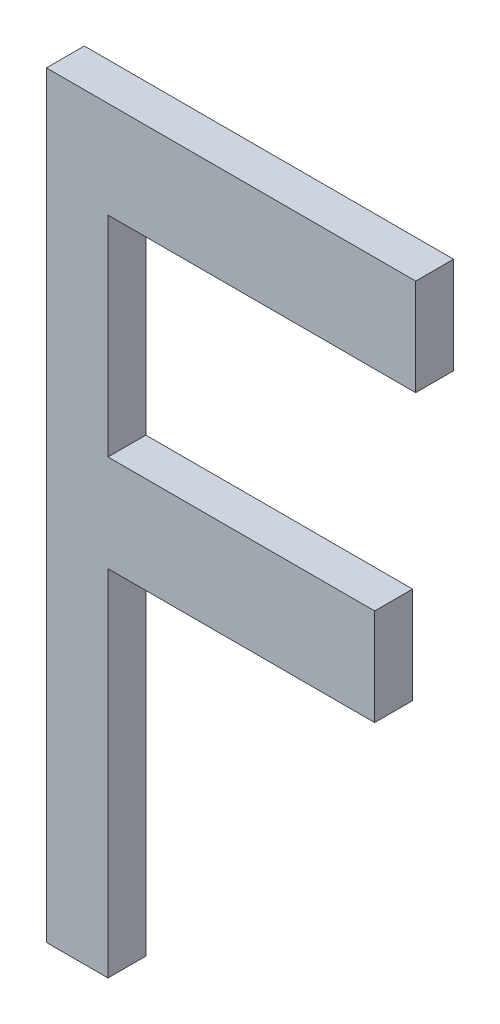
ISO-10303-21;
HEADER;
FILE_DESCRIPTION(('STEP AP214'),'2;1');
FILE_NAME('part.step','',(''),(''),'','','');
FILE_SCHEMA(('AUTOMOTIVE_DESIGN { 1 0 10303 214 1 1 1 1 }'));
ENDSEC;
DATA;
#1=APPLICATION_CONTEXT('core data for automotive mechanical design processes');
#2=APPLICATION_PROTOCOL_DEFINITION('international standard','automotive_design',2000,#1);
#3=PRODUCT_CONTEXT('',#1,'mechanical');
#4=PRODUCT('Part','Part','',(#3));
#5=PRODUCT_RELATED_PRODUCT_CATEGORY('part','',(#4));
#6=PRODUCT_DEFINITION_FORMATION('','',#4);
#7=PRODUCT_DEFINITION_CONTEXT('part definition',#1,'design');
#8=PRODUCT_DEFINITION('design','',#6,#7);
#9=PRODUCT_DEFINITION_SHAPE('','',#8);
#10=(LENGTH_UNIT() NAMED_UNIT(*) SI_UNIT(.MILLI.,.METRE.));
#11=(NAMED_UNIT(*) PLANE_ANGLE_UNIT() SI_UNIT($,.RADIAN.));
#12=(NAMED_UNIT(*) SI_UNIT($,.STERADIAN.) SOLID_ANGLE_UNIT());
#13=UNCERTAINTY_MEASURE_WITH_UNIT(LENGTH_MEASURE(1.E-05),#10,'distance_accuracy_value','');
#14=(GEOMETRIC_REPRESENTATION_CONTEXT(3) GLOBAL_UNCERTAINTY_ASSIGNED_CONTEXT((#13)) GLOBAL_UNIT_ASSIGNED_CONTEXT((#10,
#11,#12)) REPRESENTATION_CONTEXT('',''));
#15=CARTESIAN_POINT('',(0.,0.,0.));
#16=DIRECTION('',(0.,0.,1.));
#17=DIRECTION('',(1.,0.,0.));
#18=AXIS2_PLACEMENT_3D('',#15,#16,#17);
#19=CARTESIAN_POINT('',(51.9128238250903,28.1761107349725,5.9));
#20=DIRECTION('',(0.,0.,1.));
#21=DIRECTION('',(1.,0.,0.));
#22=AXIS2_PLACEMENT_3D('',#19,#20,#21);
#23=PLANE('',#22);
#24=DIRECTION('',(1.,0.,0.));
#25=VECTOR('',#24,1.);
#26=CARTESIAN_POINT('',(51.9128238250903,30.1761107349725,5.9));
#27=LINE('',#26,#25);
#28=CARTESIAN_POINT('',(52.8878238250904,30.1761107349725,5.9));
#29=VERTEX_POINT('',#28);
#30=CARTESIAN_POINT('',(51.9128238250904,30.1761107349725,5.9));
#31=VERTEX_POINT('',#30);
#32=EDGE_CURVE('E126',#29,#31,#27,.F.);
#33=ORIENTED_EDGE('',*,*,#32,.F.);
#34=DIRECTION('',(0.,1.,0.));
#35=VECTOR('',#34,1.);
#36=CARTESIAN_POINT('',(52.8878238250904,28.1761107349725,5.9));
#37=LINE('',#36,#35);
#38=CARTESIAN_POINT('',(52.8878238250904,29.9207916164725,5.9));
#39=VERTEX_POINT('',#38);
#40=EDGE_CURVE('E124',#39,#29,#37,.T.);
#41=ORIENTED_EDGE('',*,*,#40,.F.);
#42=DIRECTION('',(1.,0.,0.));
#43=VECTOR('',#42,1.);
#44=CARTESIAN_POINT('',(51.9128238250903,29.9207916164725,5.9));
#45=LINE('',#44,#43);
#46=CARTESIAN_POINT('',(52.0753238250903,29.9207916164725,5.9));
#47=VERTEX_POINT('',#46);
#48=EDGE_CURVE('E122',#47,#39,#45,.T.);
#49=ORIENTED_EDGE('',*,*,#48,.F.);
#50=DIRECTION('',(0.,1.,0.));
#51=VECTOR('',#50,1.);
#52=CARTESIAN_POINT('',(52.0753238250903,28.1761107349725,5.9));
#53=LINE('',#52,#51);
#54=CARTESIAN_POINT('',(52.0753238250903,29.3676000738525,5.9));
#55=VERTEX_POINT('',#54);
#56=EDGE_CURVE('E120',#55,#47,#53,.T.);
#57=ORIENTED_EDGE('',*,*,#56,.F.);
#58=DIRECTION('',(1.,0.,0.));
#59=VECTOR('',#58,1.);
#60=CARTESIAN_POINT('',(51.9128238250903,29.3676000738525,5.9));
#61=LINE('',#60,#59);
#62=CARTESIAN_POINT('',(52.7794905175803,29.3676000738525,5.9));
#63=VERTEX_POINT('',#62);
#64=EDGE_CURVE('E118',#63,#55,#61,.F.);
#65=ORIENTED_EDGE('',*,*,#64,.F.);
#66=DIRECTION('',(0.,1.,0.));
#67=VECTOR('',#66,1.);
#68=CARTESIAN_POINT('',(52.7794905175803,28.1761107349725,5.9));
#69=LINE('',#68,#67);
#70=CARTESIAN_POINT('',(52.7794905175803,29.1122809553525,5.9));
#71=VERTEX_POINT('',#70);
#72=EDGE_CURVE('E114',#71,#63,#69,.T.);
#73=ORIENTED_EDGE('',*,*,#72,.F.);
#74=DIRECTION('',(1.,0.,0.));
#75=VECTOR('',#74,1.);
#76=CARTESIAN_POINT('',(51.9128238250903,29.1122809553525,5.9));
#77=LINE('',#76,#75);
#78=CARTESIAN_POINT('',(52.0753238250903,29.1122809553525,5.9));
#79=VERTEX_POINT('',#78);
#80=EDGE_CURVE('E113',#79,#71,#77,.T.);
#81=ORIENTED_EDGE('',*,*,#80,.F.);
#82=DIRECTION('',(0.,1.,0.));
#83=VECTOR('',#82,1.);
#84=CARTESIAN_POINT('',(52.0753238250903,28.1761107349725,5.9));
#85=LINE('',#84,#83);
#86=CARTESIAN_POINT('',(52.0753238250903,28.1761107349725,5.9));
#87=VERTEX_POINT('',#86);
#88=EDGE_CURVE('E91',#87,#79,#85,.T.);
#89=ORIENTED_EDGE('',*,*,#88,.F.);
#90=DIRECTION('',(1.,0.,0.));
#91=VECTOR('',#90,1.);
#92=CARTESIAN_POINT('',(51.9128238250903,28.1761107349725,5.9));
#93=LINE('',#92,#91);
#94=CARTESIAN_POINT('',(51.9128238250904,28.1761107349725,5.9));
#95=VERTEX_POINT('',#94);
#96=EDGE_CURVE('E20',#95,#87,#93,.T.);
#97=ORIENTED_EDGE('',*,*,#96,.F.);
#98=DIRECTION('',(0.,1.,0.));
#99=VECTOR('',#98,1.);
#100=CARTESIAN_POINT('',(51.9128238250904,30.1761107349725,5.9));
#101=LINE('',#100,#99);
#102=EDGE_CURVE('E128',#95,#31,#101,.T.);
#103=ORIENTED_EDGE('',*,*,#102,.T.);
#104=EDGE_LOOP('',(#33,#41,#49,#57,#65,#73,#81,#89,#97,#103));
#105=FACE_BOUND('',#104,.T.);
#106=ADVANCED_FACE('F17',(#105),#23,.F.);
#107=CARTESIAN_POINT('',(51.9128238250904,30.1761107349725,6.));
#108=DIRECTION('',(1.,0.,0.));
#109=DIRECTION('',(0.,1.,0.));
#110=AXIS2_PLACEMENT_3D('',#107,#108,#109);
#111=PLANE('',#110);
#112=DIRECTION('',(0.,0.,1.));
#113=VECTOR('',#112,1.);
#114=CARTESIAN_POINT('',(51.9128238250903,28.1761107349725,6.));
#115=LINE('',#114,#113);
#116=CARTESIAN_POINT('',(51.9128238250904,28.1761107349725,6.));
#117=VERTEX_POINT('',#116);
#118=EDGE_CURVE('E100',#95,#117,#115,.T.);
#119=ORIENTED_EDGE('',*,*,#118,.T.);
#120=DIRECTION('',(0.,1.,0.));
#121=VECTOR('',#120,1.);
#122=CARTESIAN_POINT('',(51.9128238250904,28.1761107349725,6.));
#123=LINE('',#122,#121);
#124=CARTESIAN_POINT('',(51.9128238250904,30.1761107349725,6.));
#125=VERTEX_POINT('',#124);
#126=EDGE_CURVE('E146',#125,#117,#123,.F.);
#127=ORIENTED_EDGE('',*,*,#126,.F.);
#128=DIRECTION('',(0.,0.,-1.));
#129=VECTOR('',#128,1.);
#130=CARTESIAN_POINT('',(51.9128238250904,30.1761107349725,6.));
#131=LINE('',#130,#129);
#132=EDGE_CURVE('E143',#125,#31,#131,.T.);
#133=ORIENTED_EDGE('',*,*,#132,.T.);
#134=ORIENTED_EDGE('',*,*,#102,.F.);
#135=EDGE_LOOP('',(#119,#127,#133,#134));
#136=FACE_BOUND('',#135,.T.);
#137=ADVANCED_FACE('F181',(#136),#111,.F.);
#138=CARTESIAN_POINT('',(51.9128238250903,28.1761107349725,6.));
#139=DIRECTION('',(0.,1.,0.));
#140=DIRECTION('',(0.,0.,1.));
#141=AXIS2_PLACEMENT_3D('',#138,#139,#140);
#142=PLANE('',#141);
#143=DIRECTION('',(0.,0.,1.));
#144=VECTOR('',#143,1.);
#145=CARTESIAN_POINT('',(52.0753238250903,28.1761107349725,6.));
#146=LINE('',#145,#144);
#147=CARTESIAN_POINT('',(52.0753238250903,28.1761107349725,6.));
#148=VERTEX_POINT('',#147);
#149=EDGE_CURVE('E98',#87,#148,#146,.T.);
#150=ORIENTED_EDGE('',*,*,#149,.T.);
#151=DIRECTION('',(1.,0.,0.));
#152=VECTOR('',#151,1.);
#153=CARTESIAN_POINT('',(51.9128238250903,28.1761107349725,6.));
#154=LINE('',#153,#152);
#155=EDGE_CURVE('E149',#117,#148,#154,.T.);
#156=ORIENTED_EDGE('',*,*,#155,.F.);
#157=ORIENTED_EDGE('',*,*,#118,.F.);
#158=ORIENTED_EDGE('',*,*,#96,.T.);
#159=EDGE_LOOP('',(#150,#156,#157,#158));
#160=FACE_BOUND('',#159,.T.);
#161=ADVANCED_FACE('F96',(#160),#142,.F.);
#162=CARTESIAN_POINT('',(52.0753238250903,28.1761107349725,6.));
#163=DIRECTION('',(-1.,0.,0.));
#164=DIRECTION('',(0.,0.,1.));
#165=AXIS2_PLACEMENT_3D('',#162,#163,#164);
#166=PLANE('',#165);
#167=DIRECTION('',(0.,0.,1.));
#168=VECTOR('',#167,1.);
#169=CARTESIAN_POINT('',(52.0753238250903,29.1122809553525,6.));
#170=LINE('',#169,#168);
#171=CARTESIAN_POINT('',(52.0753238250903,29.1122809553525,6.));
#172=VERTEX_POINT('',#171);
#173=EDGE_CURVE('E108',#79,#172,#170,.T.);
#174=ORIENTED_EDGE('',*,*,#173,.T.);
#175=DIRECTION('',(0.,1.,0.));
#176=VECTOR('',#175,1.);
#177=CARTESIAN_POINT('',(52.0753238250903,28.1761107349725,6.));
#178=LINE('',#177,#176);
#179=EDGE_CURVE('E106',#148,#172,#178,.T.);
#180=ORIENTED_EDGE('',*,*,#179,.F.);
#181=ORIENTED_EDGE('',*,*,#149,.F.);
#182=ORIENTED_EDGE('',*,*,#88,.T.);
#183=EDGE_LOOP('',(#174,#180,#181,#182));
#184=FACE_BOUND('',#183,.T.);
#185=ADVANCED_FACE('F104',(#184),#166,.F.);
#186=CARTESIAN_POINT('',(52.0753238250903,29.1122809553525,6.));
#187=DIRECTION('',(0.,1.,0.));
#188=DIRECTION('',(0.,0.,1.));
#189=AXIS2_PLACEMENT_3D('',#186,#187,#188);
#190=PLANE('',#189);
#191=DIRECTION('',(0.,0.,1.));
#192=VECTOR('',#191,1.);
#193=CARTESIAN_POINT('',(52.7794905175803,29.1122809553525,6.));
#194=LINE('',#193,#192);
#195=CARTESIAN_POINT('',(52.7794905175803,29.1122809553525,6.));
#196=VERTEX_POINT('',#195);
#197=EDGE_CURVE('E132',#71,#196,#194,.T.);
#198=ORIENTED_EDGE('',*,*,#197,.T.);
#199=DIRECTION('',(1.,0.,0.));
#200=VECTOR('',#199,1.);
#201=CARTESIAN_POINT('',(51.9128238250903,29.1122809553525,6.));
#202=LINE('',#201,#200);
#203=EDGE_CURVE('E152',#172,#196,#202,.T.);
#204=ORIENTED_EDGE('',*,*,#203,.F.);
#205=ORIENTED_EDGE('',*,*,#173,.F.);
#206=ORIENTED_EDGE('',*,*,#80,.T.);
#207=EDGE_LOOP('',(#198,#204,#205,#206));
#208=FACE_BOUND('',#207,.T.);
#209=ADVANCED_FACE('F185',(#208),#190,.F.);
#210=CARTESIAN_POINT('',(52.7794905175803,29.1122809553525,6.));
#211=DIRECTION('',(-1.,0.,0.));
#212=DIRECTION('',(0.,0.,1.));
#213=AXIS2_PLACEMENT_3D('',#210,#211,#212);
#214=PLANE('',#213);
#215=DIRECTION('',(0.,0.,-1.));
#216=VECTOR('',#215,1.);
#217=CARTESIAN_POINT('',(52.7794905175803,29.3676000738525,6.));
#218=LINE('',#217,#216);
#219=CARTESIAN_POINT('',(52.7794905175803,29.3676000738525,6.));
#220=VERTEX_POINT('',#219);
#221=EDGE_CURVE('E134',#63,#220,#218,.F.);
#222=ORIENTED_EDGE('',*,*,#221,.T.);
#223=DIRECTION('',(0.,1.,0.));
#224=VECTOR('',#223,1.);
#225=CARTESIAN_POINT('',(52.7794905175803,28.1761107349725,6.));
#226=LINE('',#225,#224);
#227=EDGE_CURVE('E155',#196,#220,#226,.T.);
#228=ORIENTED_EDGE('',*,*,#227,.F.);
#229=ORIENTED_EDGE('',*,*,#197,.F.);
#230=ORIENTED_EDGE('',*,*,#72,.T.);
#231=EDGE_LOOP('',(#222,#228,#229,#230));
#232=FACE_BOUND('',#231,.T.);
#233=ADVANCED_FACE('F188',(#232),#214,.F.);
#234=CARTESIAN_POINT('',(52.7794905175803,29.3676000738525,6.));
#235=DIRECTION('',(0.,-1.,0.));
#236=DIRECTION('',(0.,0.,-1.));
#237=AXIS2_PLACEMENT_3D('',#234,#235,#236);
#238=PLANE('',#237);
#239=DIRECTION('',(0.,0.,1.));
#240=VECTOR('',#239,1.);
#241=CARTESIAN_POINT('',(52.0753238250903,29.3676000738525,6.));
#242=LINE('',#241,#240);
#243=CARTESIAN_POINT('',(52.0753238250903,29.3676000738525,6.));
#244=VERTEX_POINT('',#243);
#245=EDGE_CURVE('E136',#55,#244,#242,.T.);
#246=ORIENTED_EDGE('',*,*,#245,.T.);
#247=DIRECTION('',(1.,0.,0.));
#248=VECTOR('',#247,1.);
#249=CARTESIAN_POINT('',(51.9128238250903,29.3676000738525,6.));
#250=LINE('',#249,#248);
#251=EDGE_CURVE('E158',#220,#244,#250,.F.);
#252=ORIENTED_EDGE('',*,*,#251,.F.);
#253=ORIENTED_EDGE('',*,*,#221,.F.);
#254=ORIENTED_EDGE('',*,*,#64,.T.);
#255=EDGE_LOOP('',(#246,#252,#253,#254));
#256=FACE_BOUND('',#255,.T.);
#257=ADVANCED_FACE('F193',(#256),#238,.F.);
#258=CARTESIAN_POINT('',(52.0753238250903,29.3676000738525,6.));
#259=DIRECTION('',(-1.,0.,0.));
#260=DIRECTION('',(0.,0.,1.));
#261=AXIS2_PLACEMENT_3D('',#258,#259,#260);
#262=PLANE('',#261);
#263=DIRECTION('',(0.,0.,1.));
#264=VECTOR('',#263,1.);
#265=CARTESIAN_POINT('',(52.0753238250903,29.9207916164725,6.));
#266=LINE('',#265,#264);
#267=CARTESIAN_POINT('',(52.0753238250903,29.9207916164725,6.));
#268=VERTEX_POINT('',#267);
#269=EDGE_CURVE('E138',#47,#268,#266,.T.);
#270=ORIENTED_EDGE('',*,*,#269,.T.);
#271=DIRECTION('',(0.,1.,0.));
#272=VECTOR('',#271,1.);
#273=CARTESIAN_POINT('',(52.0753238250903,28.1761107349725,6.));
#274=LINE('',#273,#272);
#275=EDGE_CURVE('E161',#244,#268,#274,.T.);
#276=ORIENTED_EDGE('',*,*,#275,.F.);
#277=ORIENTED_EDGE('',*,*,#245,.F.);
#278=ORIENTED_EDGE('',*,*,#56,.T.);
#279=EDGE_LOOP('',(#270,#276,#277,#278));
#280=FACE_BOUND('',#279,.T.);
#281=ADVANCED_FACE('F197',(#280),#262,.F.);
#282=CARTESIAN_POINT('',(52.0753238250903,29.9207916164725,6.));
#283=DIRECTION('',(0.,1.,0.));
#284=DIRECTION('',(0.,0.,1.));
#285=AXIS2_PLACEMENT_3D('',#282,#283,#284);
#286=PLANE('',#285);
#287=DIRECTION('',(0.,0.,1.));
#288=VECTOR('',#287,1.);
#289=CARTESIAN_POINT('',(52.8878238250904,29.9207916164725,6.));
#290=LINE('',#289,#288);
#291=CARTESIAN_POINT('',(52.8878238250904,29.9207916164725,6.));
#292=VERTEX_POINT('',#291);
#293=EDGE_CURVE('E140',#39,#292,#290,.T.);
#294=ORIENTED_EDGE('',*,*,#293,.T.);
#295=DIRECTION('',(1.,0.,0.));
#296=VECTOR('',#295,1.);
#297=CARTESIAN_POINT('',(51.9128238250903,29.9207916164725,6.));
#298=LINE('',#297,#296);
#299=EDGE_CURVE('E164',#268,#292,#298,.T.);
#300=ORIENTED_EDGE('',*,*,#299,.F.);
#301=ORIENTED_EDGE('',*,*,#269,.F.);
#302=ORIENTED_EDGE('',*,*,#48,.T.);
#303=EDGE_LOOP('',(#294,#300,#301,#302));
#304=FACE_BOUND('',#303,.T.);
#305=ADVANCED_FACE('F199',(#304),#286,.F.);
#306=CARTESIAN_POINT('',(52.8878238250904,29.9207916164725,6.));
#307=DIRECTION('',(-1.,0.,0.));
#308=DIRECTION('',(0.,0.,1.));
#309=AXIS2_PLACEMENT_3D('',#306,#307,#308);
#310=PLANE('',#309);
#311=DIRECTION('',(0.,0.,-1.));
#312=VECTOR('',#311,1.);
#313=CARTESIAN_POINT('',(52.8878238250904,30.1761107349725,6.));
#314=LINE('',#313,#312);
#315=CARTESIAN_POINT('',(52.8878238250904,30.1761107349725,6.));
#316=VERTEX_POINT('',#315);
#317=EDGE_CURVE('E35',#29,#316,#314,.F.);
#318=ORIENTED_EDGE('',*,*,#317,.T.);
#319=DIRECTION('',(0.,1.,0.));
#320=VECTOR('',#319,1.);
#321=CARTESIAN_POINT('',(52.8878238250904,28.1761107349725,6.));
#322=LINE('',#321,#320);
#323=EDGE_CURVE('E26',#292,#316,#322,.T.);
#324=ORIENTED_EDGE('',*,*,#323,.F.);
#325=ORIENTED_EDGE('',*,*,#293,.F.);
#326=ORIENTED_EDGE('',*,*,#40,.T.);
#327=EDGE_LOOP('',(#318,#324,#325,#326));
#328=FACE_BOUND('',#327,.T.);
#329=ADVANCED_FACE('F172',(#328),#310,.F.);
#330=CARTESIAN_POINT('',(52.8878238250904,30.1761107349725,6.));
#331=DIRECTION('',(0.,-1.,0.));
#332=DIRECTION('',(0.,0.,-1.));
#333=AXIS2_PLACEMENT_3D('',#330,#331,#332);
#334=PLANE('',#333);
#335=ORIENTED_EDGE('',*,*,#132,.F.);
#336=DIRECTION('',(1.,0.,0.));
#337=VECTOR('',#336,1.);
#338=CARTESIAN_POINT('',(51.9128238250903,30.1761107349725,6.));
#339=LINE('',#338,#337);
#340=EDGE_CURVE('E11',#316,#125,#339,.F.);
#341=ORIENTED_EDGE('',*,*,#340,.F.);
#342=ORIENTED_EDGE('',*,*,#317,.F.);
#343=ORIENTED_EDGE('',*,*,#32,.T.);
#344=EDGE_LOOP('',(#335,#341,#342,#343));
#345=FACE_BOUND('',#344,.T.);
#346=ADVANCED_FACE('F179',(#345),#334,.F.);
#347=CARTESIAN_POINT('',(51.9128238250903,28.1761107349725,6.));
#348=DIRECTION('',(0.,0.,1.));
#349=DIRECTION('',(1.,0.,0.));
#350=AXIS2_PLACEMENT_3D('',#347,#348,#349);
#351=PLANE('',#350);
#352=ORIENTED_EDGE('',*,*,#323,.T.);
#353=ORIENTED_EDGE('',*,*,#340,.T.);
#354=ORIENTED_EDGE('',*,*,#126,.T.);
#355=ORIENTED_EDGE('',*,*,#155,.T.);
#356=ORIENTED_EDGE('',*,*,#179,.T.);
#357=ORIENTED_EDGE('',*,*,#203,.T.);
#358=ORIENTED_EDGE('',*,*,#227,.T.);
#359=ORIENTED_EDGE('',*,*,#251,.T.);
#360=ORIENTED_EDGE('',*,*,#275,.T.);
#361=ORIENTED_EDGE('',*,*,#299,.T.);
#362=EDGE_LOOP('',(#352,#353,#354,#355,#356,#357,#358,#359,#360,#361));
#363=FACE_BOUND('',#362,.T.);
#364=ADVANCED_FACE('F169',(#363),#351,.T.);
#365=CLOSED_SHELL('',(#106,#137,#161,#185,#209,#233,#257,#281,#305,#329,#346,#364));
#366=MANIFOLD_SOLID_BREP('B1',#365);
#367=ADVANCED_BREP_SHAPE_REPRESENTATION('',(#18,#366),#14);
#368=SHAPE_DEFINITION_REPRESENTATION(#9,#367);
ENDSEC;
END-ISO-10303-21;
